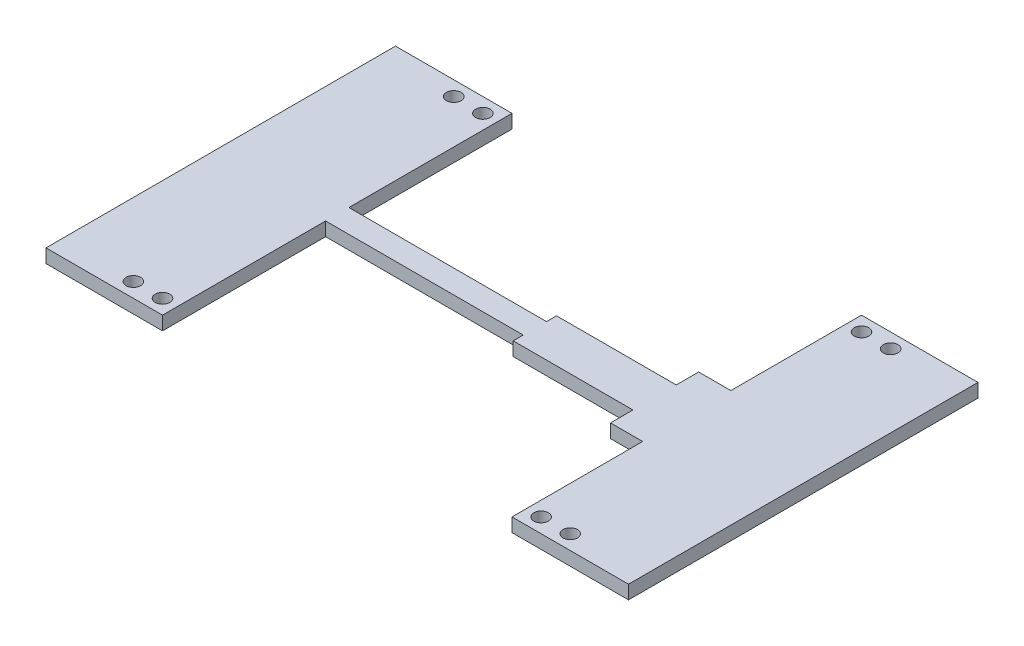
ISO-10303-21;
HEADER;
FILE_DESCRIPTION(('STEP AP214'),'2;1');
FILE_NAME('part.step','',(''),(''),'','','');
FILE_SCHEMA(('AUTOMOTIVE_DESIGN { 1 0 10303 214 1 1 1 1 }'));
ENDSEC;
DATA;
#1=APPLICATION_CONTEXT('core data for automotive mechanical design processes');
#2=APPLICATION_PROTOCOL_DEFINITION('international standard','automotive_design',2000,#1);
#3=PRODUCT_CONTEXT('',#1,'mechanical');
#4=PRODUCT('Part','Part','',(#3));
#5=PRODUCT_RELATED_PRODUCT_CATEGORY('part','',(#4));
#6=PRODUCT_DEFINITION_FORMATION('','',#4);
#7=PRODUCT_DEFINITION_CONTEXT('part definition',#1,'design');
#8=PRODUCT_DEFINITION('design','',#6,#7);
#9=PRODUCT_DEFINITION_SHAPE('','',#8);
#10=(LENGTH_UNIT() NAMED_UNIT(*) SI_UNIT(.MILLI.,.METRE.));
#11=(NAMED_UNIT(*) PLANE_ANGLE_UNIT() SI_UNIT($,.RADIAN.));
#12=(NAMED_UNIT(*) SI_UNIT($,.STERADIAN.) SOLID_ANGLE_UNIT());
#13=UNCERTAINTY_MEASURE_WITH_UNIT(LENGTH_MEASURE(1.E-05),#10,'distance_accuracy_value','');
#14=(GEOMETRIC_REPRESENTATION_CONTEXT(3) GLOBAL_UNCERTAINTY_ASSIGNED_CONTEXT((#13)) GLOBAL_UNIT_ASSIGNED_CONTEXT((#10,
#11,#12)) REPRESENTATION_CONTEXT('',''));
#15=CARTESIAN_POINT('',(0.,0.,0.));
#16=DIRECTION('',(0.,0.,1.));
#17=DIRECTION('',(1.,0.,0.));
#18=AXIS2_PLACEMENT_3D('',#15,#16,#17);
#19=CARTESIAN_POINT('',(-63.5,2.9718,-38.1));
#20=DIRECTION('',(0.,0.,1.));
#21=DIRECTION('',(1.,0.,0.));
#22=AXIS2_PLACEMENT_3D('',#19,#20,#21);
#23=PLANE('',#22);
#24=DIRECTION('',(0.,1.,0.));
#25=VECTOR('',#24,1.);
#26=CARTESIAN_POINT('',(-38.1,0.,-38.1));
#27=LINE('',#26,#25);
#28=CARTESIAN_POINT('',(-38.1,0.,-38.1));
#29=VERTEX_POINT('',#28);
#30=CARTESIAN_POINT('',(-38.1,2.9718,-38.1));
#31=VERTEX_POINT('',#30);
#32=EDGE_CURVE('E289',#29,#31,#27,.T.);
#33=ORIENTED_EDGE('',*,*,#32,.F.);
#34=DIRECTION('',(-1.,0.,0.));
#35=VECTOR('',#34,1.);
#36=CARTESIAN_POINT('',(-63.5,0.,-38.1));
#37=LINE('',#36,#35);
#38=CARTESIAN_POINT('',(-63.5,0.,-38.1));
#39=VERTEX_POINT('',#38);
#40=EDGE_CURVE('E239',#29,#39,#37,.T.);
#41=ORIENTED_EDGE('',*,*,#40,.T.);
#42=DIRECTION('',(0.,-1.,0.));
#43=VECTOR('',#42,1.);
#44=CARTESIAN_POINT('',(-63.5,2.9718,-38.1));
#45=LINE('',#44,#43);
#46=CARTESIAN_POINT('',(-63.5,2.9718,-38.1));
#47=VERTEX_POINT('',#46);
#48=EDGE_CURVE('E50',#47,#39,#45,.T.);
#49=ORIENTED_EDGE('',*,*,#48,.F.);
#50=DIRECTION('',(-1.,0.,0.));
#51=VECTOR('',#50,1.);
#52=CARTESIAN_POINT('',(-63.5,2.9718,-38.1));
#53=LINE('',#52,#51);
#54=EDGE_CURVE('E419',#31,#47,#53,.T.);
#55=ORIENTED_EDGE('',*,*,#54,.F.);
#56=EDGE_LOOP('',(#33,#41,#49,#55));
#57=FACE_BOUND('',#56,.T.);
#58=ADVANCED_FACE('F41',(#57),#23,.F.);
#59=CARTESIAN_POINT('',(0.,2.9718,0.));
#60=DIRECTION('',(0.,1.,0.));
#61=DIRECTION('',(0.,0.,1.));
#62=AXIS2_PLACEMENT_3D('',#59,#60,#61);
#63=PLANE('',#62);
#64=CARTESIAN_POINT('',(41.275,2.9718,-34.925));
#65=DIRECTION('',(0.,-1.,0.));
#66=DIRECTION('',(0.,0.,-1.));
#67=AXIS2_PLACEMENT_3D('',#64,#65,#66);
#68=CIRCLE('',#67,1.5875);
#69=CARTESIAN_POINT('',(41.275,2.9718,-36.5125));
#70=VERTEX_POINT('',#69);
#71=EDGE_CURVE('E248',#70,#70,#68,.T.);
#72=ORIENTED_EDGE('',*,*,#71,.T.);
#73=EDGE_LOOP('',(#72));
#74=FACE_BOUND('',#73,.T.);
#75=CARTESIAN_POINT('',(47.625,2.9718,-34.925));
#76=DIRECTION('',(0.,-1.,0.));
#77=DIRECTION('',(0.,0.,-1.));
#78=AXIS2_PLACEMENT_3D('',#75,#76,#77);
#79=CIRCLE('',#78,1.5875);
#80=CARTESIAN_POINT('',(47.625,2.9718,-36.5125));
#81=VERTEX_POINT('',#80);
#82=EDGE_CURVE('E482',#81,#81,#79,.T.);
#83=ORIENTED_EDGE('',*,*,#82,.T.);
#84=EDGE_LOOP('',(#83));
#85=FACE_BOUND('',#84,.T.);
#86=CARTESIAN_POINT('',(-41.275,2.9718,34.925));
#87=DIRECTION('',(0.,1.,0.));
#88=DIRECTION('',(0.,0.,1.));
#89=AXIS2_PLACEMENT_3D('',#86,#87,#88);
#90=CIRCLE('',#89,1.5875);
#91=CARTESIAN_POINT('',(-41.275,2.9718,36.5125));
#92=VERTEX_POINT('',#91);
#93=EDGE_CURVE('E326',#92,#92,#90,.T.);
#94=ORIENTED_EDGE('',*,*,#93,.F.);
#95=EDGE_LOOP('',(#94));
#96=FACE_BOUND('',#95,.T.);
#97=CARTESIAN_POINT('',(41.275,2.9718,34.925));
#98=DIRECTION('',(0.,1.,0.));
#99=DIRECTION('',(0.,0.,1.));
#100=AXIS2_PLACEMENT_3D('',#97,#98,#99);
#101=CIRCLE('',#100,1.5875);
#102=CARTESIAN_POINT('',(41.275,2.9718,36.5125));
#103=VERTEX_POINT('',#102);
#104=EDGE_CURVE('E335',#103,#103,#101,.T.);
#105=ORIENTED_EDGE('',*,*,#104,.F.);
#106=EDGE_LOOP('',(#105));
#107=FACE_BOUND('',#106,.T.);
#108=CARTESIAN_POINT('',(-47.625,2.9718,34.925));
#109=DIRECTION('',(0.,1.,0.));
#110=DIRECTION('',(0.,0.,1.));
#111=AXIS2_PLACEMENT_3D('',#108,#109,#110);
#112=CIRCLE('',#111,1.5875);
#113=CARTESIAN_POINT('',(-47.625,2.9718,36.5125));
#114=VERTEX_POINT('',#113);
#115=EDGE_CURVE('E310',#114,#114,#112,.T.);
#116=ORIENTED_EDGE('',*,*,#115,.F.);
#117=EDGE_LOOP('',(#116));
#118=FACE_BOUND('',#117,.T.);
#119=CARTESIAN_POINT('',(47.625,2.9718,34.925));
#120=DIRECTION('',(0.,1.,0.));
#121=DIRECTION('',(0.,0.,1.));
#122=AXIS2_PLACEMENT_3D('',#119,#120,#121);
#123=CIRCLE('',#122,1.5875);
#124=CARTESIAN_POINT('',(47.625,2.9718,36.5125));
#125=VERTEX_POINT('',#124);
#126=EDGE_CURVE('E319',#125,#125,#123,.T.);
#127=ORIENTED_EDGE('',*,*,#126,.F.);
#128=EDGE_LOOP('',(#127));
#129=FACE_BOUND('',#128,.T.);
#130=DIRECTION('',(1.,0.,0.));
#131=VECTOR('',#130,1.);
#132=CARTESIAN_POINT('',(0.,2.9718,-2.54000000000002));
#133=LINE('',#132,#131);
#134=CARTESIAN_POINT('',(-38.1,2.9718,-2.54000000000002));
#135=VERTEX_POINT('',#134);
#136=CARTESIAN_POINT('',(4.97874959599973,2.9718,-2.54000000000002));
#137=VERTEX_POINT('',#136);
#138=EDGE_CURVE('E270',#135,#137,#133,.T.);
#139=ORIENTED_EDGE('',*,*,#138,.F.);
#140=DIRECTION('',(0.,0.,-1.));
#141=VECTOR('',#140,1.);
#142=CARTESIAN_POINT('',(-38.1,2.9718,0.));
#143=LINE('',#142,#141);
#144=EDGE_CURVE('E221',#135,#31,#143,.T.);
#145=ORIENTED_EDGE('',*,*,#144,.T.);
#146=ORIENTED_EDGE('',*,*,#54,.T.);
#147=DIRECTION('',(0.,0.,1.));
#148=VECTOR('',#147,1.);
#149=CARTESIAN_POINT('',(-63.5,2.9718,-38.1));
#150=LINE('',#149,#148);
#151=CARTESIAN_POINT('',(-63.5,2.9718,38.1));
#152=VERTEX_POINT('',#151);
#153=EDGE_CURVE('E425',#47,#152,#150,.T.);
#154=ORIENTED_EDGE('',*,*,#153,.T.);
#155=DIRECTION('',(1.,0.,0.));
#156=VECTOR('',#155,1.);
#157=CARTESIAN_POINT('',(-63.5,2.9718,38.1));
#158=LINE('',#157,#156);
#159=CARTESIAN_POINT('',(-38.1,2.9718,38.1));
#160=VERTEX_POINT('',#159);
#161=EDGE_CURVE('E429',#152,#160,#158,.T.);
#162=ORIENTED_EDGE('',*,*,#161,.T.);
#163=DIRECTION('',(0.,0.,1.));
#164=VECTOR('',#163,1.);
#165=CARTESIAN_POINT('',(-38.1,2.9718,0.));
#166=LINE('',#165,#164);
#167=CARTESIAN_POINT('',(-38.1,2.9718,2.54000000000002));
#168=VERTEX_POINT('',#167);
#169=EDGE_CURVE('E330',#168,#160,#166,.T.);
#170=ORIENTED_EDGE('',*,*,#169,.F.);
#171=DIRECTION('',(1.,0.,0.));
#172=VECTOR('',#171,1.);
#173=CARTESIAN_POINT('',(0.,2.9718,2.54000000000002));
#174=LINE('',#173,#172);
#175=CARTESIAN_POINT('',(4.97874959599973,2.9718,2.54000000000002));
#176=VERTEX_POINT('',#175);
#177=EDGE_CURVE('E347',#168,#176,#174,.T.);
#178=ORIENTED_EDGE('',*,*,#177,.T.);
#179=DIRECTION('',(0.,0.,1.));
#180=VECTOR('',#179,1.);
#181=CARTESIAN_POINT('',(4.97874959599973,2.9718,0.));
#182=LINE('',#181,#180);
#183=CARTESIAN_POINT('',(4.97874959599973,2.9718,4.72478924459127));
#184=VERTEX_POINT('',#183);
#185=EDGE_CURVE('E384',#176,#184,#182,.T.);
#186=ORIENTED_EDGE('',*,*,#185,.T.);
#187=DIRECTION('',(1.,0.,0.));
#188=VECTOR('',#187,1.);
#189=CARTESIAN_POINT('',(0.,2.9718,4.72478924459127));
#190=LINE('',#189,#188);
#191=CARTESIAN_POINT('',(31.0867343843955,2.9718,4.72478924459127));
#192=VERTEX_POINT('',#191);
#193=EDGE_CURVE('E380',#184,#192,#190,.T.);
#194=ORIENTED_EDGE('',*,*,#193,.T.);
#195=DIRECTION('',(0.,0.,1.));
#196=VECTOR('',#195,1.);
#197=CARTESIAN_POINT('',(31.0867343843955,2.9718,0.));
#198=LINE('',#197,#196);
#199=CARTESIAN_POINT('',(31.0867343843955,2.9718,9.61413539475921));
#200=VERTEX_POINT('',#199);
#201=EDGE_CURVE('E376',#192,#200,#198,.T.);
#202=ORIENTED_EDGE('',*,*,#201,.T.);
#203=DIRECTION('',(1.,0.,0.));
#204=VECTOR('',#203,1.);
#205=CARTESIAN_POINT('',(0.,2.9718,9.61413539475922));
#206=LINE('',#205,#204);
#207=CARTESIAN_POINT('',(38.1,2.9718,9.61413539475921));
#208=VERTEX_POINT('',#207);
#209=EDGE_CURVE('E372',#200,#208,#206,.T.);
#210=ORIENTED_EDGE('',*,*,#209,.T.);
#211=DIRECTION('',(0.,0.,1.));
#212=VECTOR('',#211,1.);
#213=CARTESIAN_POINT('',(38.1,2.9718,0.));
#214=LINE('',#213,#212);
#215=CARTESIAN_POINT('',(38.1,2.9718,38.1));
#216=VERTEX_POINT('',#215);
#217=EDGE_CURVE('E368',#208,#216,#214,.T.);
#218=ORIENTED_EDGE('',*,*,#217,.T.);
#219=CARTESIAN_POINT('',(63.5,2.9718,38.1));
#220=VERTEX_POINT('',#219);
#221=EDGE_CURVE('E428',#216,#220,#158,.T.);
#222=ORIENTED_EDGE('',*,*,#221,.T.);
#223=DIRECTION('',(0.,0.,-1.));
#224=VECTOR('',#223,1.);
#225=CARTESIAN_POINT('',(63.5,2.9718,-38.1));
#226=LINE('',#225,#224);
#227=CARTESIAN_POINT('',(63.5,2.9718,-38.1));
#228=VERTEX_POINT('',#227);
#229=EDGE_CURVE('E415',#220,#228,#226,.T.);
#230=ORIENTED_EDGE('',*,*,#229,.T.);
#231=CARTESIAN_POINT('',(38.1,2.9718,-38.1));
#232=VERTEX_POINT('',#231);
#233=EDGE_CURVE('E421',#228,#232,#53,.T.);
#234=ORIENTED_EDGE('',*,*,#233,.T.);
#235=DIRECTION('',(0.,0.,-1.));
#236=VECTOR('',#235,1.);
#237=CARTESIAN_POINT('',(38.1,2.9718,0.));
#238=LINE('',#237,#236);
#239=CARTESIAN_POINT('',(38.1,2.9718,-9.61413539475921));
#240=VERTEX_POINT('',#239);
#241=EDGE_CURVE('E241',#240,#232,#238,.T.);
#242=ORIENTED_EDGE('',*,*,#241,.F.);
#243=DIRECTION('',(1.,0.,0.));
#244=VECTOR('',#243,1.);
#245=CARTESIAN_POINT('',(0.,2.9718,-9.61413539475922));
#246=LINE('',#245,#244);
#247=CARTESIAN_POINT('',(31.0867343843955,2.9718,-9.61413539475921));
#248=VERTEX_POINT('',#247);
#249=EDGE_CURVE('E245',#248,#240,#246,.T.);
#250=ORIENTED_EDGE('',*,*,#249,.F.);
#251=DIRECTION('',(0.,0.,-1.));
#252=VECTOR('',#251,1.);
#253=CARTESIAN_POINT('',(31.0867343843955,2.9718,0.));
#254=LINE('',#253,#252);
#255=CARTESIAN_POINT('',(31.0867343843955,2.9718,-4.72478924459127));
#256=VERTEX_POINT('',#255);
#257=EDGE_CURVE('E282',#256,#248,#254,.T.);
#258=ORIENTED_EDGE('',*,*,#257,.F.);
#259=DIRECTION('',(1.,0.,0.));
#260=VECTOR('',#259,1.);
#261=CARTESIAN_POINT('',(0.,2.9718,-4.72478924459127));
#262=LINE('',#261,#260);
#263=CARTESIAN_POINT('',(4.97874959599973,2.9718,-4.72478924459127));
#264=VERTEX_POINT('',#263);
#265=EDGE_CURVE('E278',#264,#256,#262,.T.);
#266=ORIENTED_EDGE('',*,*,#265,.F.);
#267=DIRECTION('',(0.,0.,-1.));
#268=VECTOR('',#267,1.);
#269=CARTESIAN_POINT('',(4.97874959599973,2.9718,0.));
#270=LINE('',#269,#268);
#271=EDGE_CURVE('E274',#137,#264,#270,.T.);
#272=ORIENTED_EDGE('',*,*,#271,.F.);
#273=EDGE_LOOP('',(#139,#145,#146,#154,#162,#170,#178,#186,#194,#202,#210,#218,#222,#230,#234,
#242,#250,#258,#266,#272));
#274=FACE_BOUND('',#273,.T.);
#275=CARTESIAN_POINT('',(-47.625,2.9718,-34.925));
#276=DIRECTION('',(0.,-1.,0.));
#277=DIRECTION('',(0.,0.,-1.));
#278=AXIS2_PLACEMENT_3D('',#275,#276,#277);
#279=CIRCLE('',#278,1.5875);
#280=CARTESIAN_POINT('',(-47.625,2.9718,-36.5125));
#281=VERTEX_POINT('',#280);
#282=EDGE_CURVE('E474',#281,#281,#279,.T.);
#283=ORIENTED_EDGE('',*,*,#282,.T.);
#284=EDGE_LOOP('',(#283));
#285=FACE_BOUND('',#284,.T.);
#286=CARTESIAN_POINT('',(-41.275,2.9718,-34.925));
#287=DIRECTION('',(0.,-1.,0.));
#288=DIRECTION('',(0.,0.,-1.));
#289=AXIS2_PLACEMENT_3D('',#286,#287,#288);
#290=CIRCLE('',#289,1.5875);
#291=CARTESIAN_POINT('',(-41.275,2.9718,-36.5125));
#292=VERTEX_POINT('',#291);
#293=EDGE_CURVE('E480',#292,#292,#290,.T.);
#294=ORIENTED_EDGE('',*,*,#293,.T.);
#295=EDGE_LOOP('',(#294));
#296=FACE_BOUND('',#295,.T.);
#297=ADVANCED_FACE('F470',(#74,#85,#96,#107,#118,#129,#274,#285,#296),#63,.T.);
#298=CARTESIAN_POINT('',(0.,0.,0.));
#299=DIRECTION('',(0.,1.,0.));
#300=DIRECTION('',(0.,0.,1.));
#301=AXIS2_PLACEMENT_3D('',#298,#299,#300);
#302=PLANE('',#301);
#303=CARTESIAN_POINT('',(47.625,0.,34.925));
#304=DIRECTION('',(0.,1.,0.));
#305=DIRECTION('',(0.,0.,1.));
#306=AXIS2_PLACEMENT_3D('',#303,#304,#305);
#307=CIRCLE('',#306,1.5875);
#308=CARTESIAN_POINT('',(47.625,0.,36.5125));
#309=VERTEX_POINT('',#308);
#310=EDGE_CURVE('E291',#309,#309,#307,.T.);
#311=ORIENTED_EDGE('',*,*,#310,.T.);
#312=EDGE_LOOP('',(#311));
#313=FACE_BOUND('',#312,.T.);
#314=CARTESIAN_POINT('',(-47.625,0.,34.925));
#315=DIRECTION('',(0.,1.,0.));
#316=DIRECTION('',(0.,0.,1.));
#317=AXIS2_PLACEMENT_3D('',#314,#315,#316);
#318=CIRCLE('',#317,1.5875);
#319=CARTESIAN_POINT('',(-47.625,0.,36.5125));
#320=VERTEX_POINT('',#319);
#321=EDGE_CURVE('E315',#320,#320,#318,.T.);
#322=ORIENTED_EDGE('',*,*,#321,.T.);
#323=EDGE_LOOP('',(#322));
#324=FACE_BOUND('',#323,.T.);
#325=CARTESIAN_POINT('',(41.275,0.,34.925));
#326=DIRECTION('',(0.,1.,0.));
#327=DIRECTION('',(0.,0.,1.));
#328=AXIS2_PLACEMENT_3D('',#325,#326,#327);
#329=CIRCLE('',#328,1.5875);
#330=CARTESIAN_POINT('',(41.275,0.,36.5125));
#331=VERTEX_POINT('',#330);
#332=EDGE_CURVE('E314',#331,#331,#329,.T.);
#333=ORIENTED_EDGE('',*,*,#332,.T.);
#334=EDGE_LOOP('',(#333));
#335=FACE_BOUND('',#334,.T.);
#336=CARTESIAN_POINT('',(-41.275,0.,34.925));
#337=DIRECTION('',(0.,1.,0.));
#338=DIRECTION('',(0.,0.,1.));
#339=AXIS2_PLACEMENT_3D('',#336,#337,#338);
#340=CIRCLE('',#339,1.5875);
#341=CARTESIAN_POINT('',(-41.275,0.,36.5125));
#342=VERTEX_POINT('',#341);
#343=EDGE_CURVE('E331',#342,#342,#340,.T.);
#344=ORIENTED_EDGE('',*,*,#343,.T.);
#345=EDGE_LOOP('',(#344));
#346=FACE_BOUND('',#345,.T.);
#347=DIRECTION('',(0.,0.,-1.));
#348=VECTOR('',#347,1.);
#349=CARTESIAN_POINT('',(-38.1,0.,0.));
#350=LINE('',#349,#348);
#351=CARTESIAN_POINT('',(-38.1,0.,-2.54000000000002));
#352=VERTEX_POINT('',#351);
#353=EDGE_CURVE('E218',#352,#29,#350,.T.);
#354=ORIENTED_EDGE('',*,*,#353,.F.);
#355=DIRECTION('',(1.,0.,0.));
#356=VECTOR('',#355,1.);
#357=CARTESIAN_POINT('',(0.,0.,-2.54000000000002));
#358=LINE('',#357,#356);
#359=CARTESIAN_POINT('',(4.97874959599973,0.,-2.54000000000002));
#360=VERTEX_POINT('',#359);
#361=EDGE_CURVE('E230',#352,#360,#358,.T.);
#362=ORIENTED_EDGE('',*,*,#361,.T.);
#363=DIRECTION('',(0.,0.,-1.));
#364=VECTOR('',#363,1.);
#365=CARTESIAN_POINT('',(4.97874959599973,0.,0.));
#366=LINE('',#365,#364);
#367=CARTESIAN_POINT('',(4.97874959599973,0.,-4.72478924459127));
#368=VERTEX_POINT('',#367);
#369=EDGE_CURVE('E60',#360,#368,#366,.T.);
#370=ORIENTED_EDGE('',*,*,#369,.T.);
#371=DIRECTION('',(1.,0.,0.));
#372=VECTOR('',#371,1.);
#373=CARTESIAN_POINT('',(0.,0.,-4.72478924459127));
#374=LINE('',#373,#372);
#375=CARTESIAN_POINT('',(31.0867343843955,0.,-4.72478924459127));
#376=VERTEX_POINT('',#375);
#377=EDGE_CURVE('E253',#368,#376,#374,.T.);
#378=ORIENTED_EDGE('',*,*,#377,.T.);
#379=DIRECTION('',(0.,0.,-1.));
#380=VECTOR('',#379,1.);
#381=CARTESIAN_POINT('',(31.0867343843955,0.,0.));
#382=LINE('',#381,#380);
#383=CARTESIAN_POINT('',(31.0867343843955,0.,-9.61413539475921));
#384=VERTEX_POINT('',#383);
#385=EDGE_CURVE('E257',#376,#384,#382,.T.);
#386=ORIENTED_EDGE('',*,*,#385,.T.);
#387=DIRECTION('',(1.,0.,0.));
#388=VECTOR('',#387,1.);
#389=CARTESIAN_POINT('',(0.,0.,-9.61413539475922));
#390=LINE('',#389,#388);
#391=CARTESIAN_POINT('',(38.1,0.,-9.61413539475921));
#392=VERTEX_POINT('',#391);
#393=EDGE_CURVE('E261',#384,#392,#390,.T.);
#394=ORIENTED_EDGE('',*,*,#393,.T.);
#395=DIRECTION('',(0.,0.,-1.));
#396=VECTOR('',#395,1.);
#397=CARTESIAN_POINT('',(38.1,0.,0.));
#398=LINE('',#397,#396);
#399=CARTESIAN_POINT('',(38.1,0.,-38.1));
#400=VERTEX_POINT('',#399);
#401=EDGE_CURVE('E227',#392,#400,#398,.T.);
#402=ORIENTED_EDGE('',*,*,#401,.T.);
#403=CARTESIAN_POINT('',(63.5,0.,-38.1));
#404=VERTEX_POINT('',#403);
#405=EDGE_CURVE('E437',#404,#400,#37,.T.);
#406=ORIENTED_EDGE('',*,*,#405,.F.);
#407=DIRECTION('',(0.,0.,-1.));
#408=VECTOR('',#407,1.);
#409=CARTESIAN_POINT('',(63.5,0.,-38.1));
#410=LINE('',#409,#408);
#411=CARTESIAN_POINT('',(63.5,0.,38.1));
#412=VERTEX_POINT('',#411);
#413=EDGE_CURVE('E394',#412,#404,#410,.T.);
#414=ORIENTED_EDGE('',*,*,#413,.F.);
#415=DIRECTION('',(1.,0.,0.));
#416=VECTOR('',#415,1.);
#417=CARTESIAN_POINT('',(-63.5,0.,38.1));
#418=LINE('',#417,#416);
#419=CARTESIAN_POINT('',(38.1,0.,38.1));
#420=VERTEX_POINT('',#419);
#421=EDGE_CURVE('E444',#420,#412,#418,.T.);
#422=ORIENTED_EDGE('',*,*,#421,.F.);
#423=DIRECTION('',(0.,0.,1.));
#424=VECTOR('',#423,1.);
#425=CARTESIAN_POINT('',(38.1,0.,0.));
#426=LINE('',#425,#424);
#427=CARTESIAN_POINT('',(38.1,0.,9.61413539475921));
#428=VERTEX_POINT('',#427);
#429=EDGE_CURVE('E346',#428,#420,#426,.T.);
#430=ORIENTED_EDGE('',*,*,#429,.F.);
#431=DIRECTION('',(1.,0.,0.));
#432=VECTOR('',#431,1.);
#433=CARTESIAN_POINT('',(0.,0.,9.61413539475922));
#434=LINE('',#433,#432);
#435=CARTESIAN_POINT('',(31.0867343843955,0.,9.61413539475921));
#436=VERTEX_POINT('',#435);
#437=EDGE_CURVE('E350',#436,#428,#434,.T.);
#438=ORIENTED_EDGE('',*,*,#437,.F.);
#439=DIRECTION('',(0.,0.,1.));
#440=VECTOR('',#439,1.);
#441=CARTESIAN_POINT('',(31.0867343843955,0.,0.));
#442=LINE('',#441,#440);
#443=CARTESIAN_POINT('',(31.0867343843955,0.,4.72478924459127));
#444=VERTEX_POINT('',#443);
#445=EDGE_CURVE('E353',#444,#436,#442,.T.);
#446=ORIENTED_EDGE('',*,*,#445,.F.);
#447=DIRECTION('',(1.,0.,0.));
#448=VECTOR('',#447,1.);
#449=CARTESIAN_POINT('',(0.,0.,4.72478924459127));
#450=LINE('',#449,#448);
#451=CARTESIAN_POINT('',(4.97874959599973,0.,4.72478924459127));
#452=VERTEX_POINT('',#451);
#453=EDGE_CURVE('E356',#452,#444,#450,.T.);
#454=ORIENTED_EDGE('',*,*,#453,.F.);
#455=DIRECTION('',(0.,0.,1.));
#456=VECTOR('',#455,1.);
#457=CARTESIAN_POINT('',(4.97874959599973,0.,0.));
#458=LINE('',#457,#456);
#459=CARTESIAN_POINT('',(4.97874959599973,0.,2.54000000000002));
#460=VERTEX_POINT('',#459);
#461=EDGE_CURVE('E359',#460,#452,#458,.T.);
#462=ORIENTED_EDGE('',*,*,#461,.F.);
#463=DIRECTION('',(1.,0.,0.));
#464=VECTOR('',#463,1.);
#465=CARTESIAN_POINT('',(0.,0.,2.54000000000002));
#466=LINE('',#465,#464);
#467=CARTESIAN_POINT('',(-38.1,0.,2.54000000000002));
#468=VERTEX_POINT('',#467);
#469=EDGE_CURVE('E362',#468,#460,#466,.T.);
#470=ORIENTED_EDGE('',*,*,#469,.F.);
#471=DIRECTION('',(0.,0.,1.));
#472=VECTOR('',#471,1.);
#473=CARTESIAN_POINT('',(-38.1,0.,0.));
#474=LINE('',#473,#472);
#475=CARTESIAN_POINT('',(-38.1,0.,38.1));
#476=VERTEX_POINT('',#475);
#477=EDGE_CURVE('E342',#468,#476,#474,.T.);
#478=ORIENTED_EDGE('',*,*,#477,.T.);
#479=CARTESIAN_POINT('',(-63.5,0.,38.1));
#480=VERTEX_POINT('',#479);
#481=EDGE_CURVE('E420',#480,#476,#418,.T.);
#482=ORIENTED_EDGE('',*,*,#481,.F.);
#483=DIRECTION('',(0.,0.,1.));
#484=VECTOR('',#483,1.);
#485=CARTESIAN_POINT('',(-63.5,0.,-38.1));
#486=LINE('',#485,#484);
#487=EDGE_CURVE('E441',#39,#480,#486,.T.);
#488=ORIENTED_EDGE('',*,*,#487,.F.);
#489=ORIENTED_EDGE('',*,*,#40,.F.);
#490=EDGE_LOOP('',(#354,#362,#370,#378,#386,#394,#402,#406,#414,#422,#430,#438,#446,#454,#462,
#470,#478,#482,#488,#489));
#491=FACE_BOUND('',#490,.T.);
#492=CARTESIAN_POINT('',(47.625,0.,-34.925));
#493=DIRECTION('',(0.,-1.,0.));
#494=DIRECTION('',(0.,0.,-1.));
#495=AXIS2_PLACEMENT_3D('',#492,#493,#494);
#496=CIRCLE('',#495,1.5875);
#497=CARTESIAN_POINT('',(47.625,0.,-36.5125));
#498=VERTEX_POINT('',#497);
#499=EDGE_CURVE('E484',#498,#498,#496,.T.);
#500=ORIENTED_EDGE('',*,*,#499,.F.);
#501=EDGE_LOOP('',(#500));
#502=FACE_BOUND('',#501,.T.);
#503=CARTESIAN_POINT('',(-47.625,0.,-34.925));
#504=DIRECTION('',(0.,-1.,0.));
#505=DIRECTION('',(0.,0.,-1.));
#506=AXIS2_PLACEMENT_3D('',#503,#504,#505);
#507=CIRCLE('',#506,1.5875);
#508=CARTESIAN_POINT('',(-47.625,0.,-36.5125));
#509=VERTEX_POINT('',#508);
#510=EDGE_CURVE('E492',#509,#509,#507,.T.);
#511=ORIENTED_EDGE('',*,*,#510,.F.);
#512=EDGE_LOOP('',(#511));
#513=FACE_BOUND('',#512,.T.);
#514=CARTESIAN_POINT('',(41.275,0.,-34.925));
#515=DIRECTION('',(0.,-1.,0.));
#516=DIRECTION('',(0.,0.,-1.));
#517=AXIS2_PLACEMENT_3D('',#514,#515,#516);
#518=CIRCLE('',#517,1.5875);
#519=CARTESIAN_POINT('',(41.275,0.,-36.5125));
#520=VERTEX_POINT('',#519);
#521=EDGE_CURVE('E478',#520,#520,#518,.T.);
#522=ORIENTED_EDGE('',*,*,#521,.F.);
#523=EDGE_LOOP('',(#522));
#524=FACE_BOUND('',#523,.T.);
#525=CARTESIAN_POINT('',(-41.275,0.,-34.925));
#526=DIRECTION('',(0.,-1.,0.));
#527=DIRECTION('',(0.,0.,-1.));
#528=AXIS2_PLACEMENT_3D('',#525,#526,#527);
#529=CIRCLE('',#528,1.5875);
#530=CARTESIAN_POINT('',(-41.275,0.,-36.5125));
#531=VERTEX_POINT('',#530);
#532=EDGE_CURVE('E271',#531,#531,#529,.T.);
#533=ORIENTED_EDGE('',*,*,#532,.F.);
#534=EDGE_LOOP('',(#533));
#535=FACE_BOUND('',#534,.T.);
#536=ADVANCED_FACE('F236',(#313,#324,#335,#346,#491,#502,#513,#524,#535),#302,.F.);
#537=CARTESIAN_POINT('',(-63.5,2.9718,38.1));
#538=DIRECTION('',(0.,0.,-1.));
#539=DIRECTION('',(-1.,0.,0.));
#540=AXIS2_PLACEMENT_3D('',#537,#538,#539);
#541=PLANE('',#540);
#542=DIRECTION('',(0.,1.,0.));
#543=VECTOR('',#542,1.);
#544=CARTESIAN_POINT('',(38.1,0.,38.1));
#545=LINE('',#544,#543);
#546=EDGE_CURVE('E409',#420,#216,#545,.T.);
#547=ORIENTED_EDGE('',*,*,#546,.F.);
#548=ORIENTED_EDGE('',*,*,#421,.T.);
#549=DIRECTION('',(0.,-1.,0.));
#550=VECTOR('',#549,1.);
#551=CARTESIAN_POINT('',(63.5,2.9718,38.1));
#552=LINE('',#551,#550);
#553=EDGE_CURVE('E433',#220,#412,#552,.T.);
#554=ORIENTED_EDGE('',*,*,#553,.F.);
#555=ORIENTED_EDGE('',*,*,#221,.F.);
#556=EDGE_LOOP('',(#547,#548,#554,#555));
#557=FACE_BOUND('',#556,.T.);
#558=ADVANCED_FACE('F531',(#557),#541,.F.);
#559=CARTESIAN_POINT('',(63.5,2.9718,-38.1));
#560=DIRECTION('',(-1.,0.,0.));
#561=DIRECTION('',(0.,0.,1.));
#562=AXIS2_PLACEMENT_3D('',#559,#560,#561);
#563=PLANE('',#562);
#564=ORIENTED_EDGE('',*,*,#413,.T.);
#565=DIRECTION('',(0.,-1.,0.));
#566=VECTOR('',#565,1.);
#567=CARTESIAN_POINT('',(63.5,2.9718,-38.1));
#568=LINE('',#567,#566);
#569=EDGE_CURVE('E11',#228,#404,#568,.T.);
#570=ORIENTED_EDGE('',*,*,#569,.F.);
#571=ORIENTED_EDGE('',*,*,#229,.F.);
#572=ORIENTED_EDGE('',*,*,#553,.T.);
#573=EDGE_LOOP('',(#564,#570,#571,#572));
#574=FACE_BOUND('',#573,.T.);
#575=ADVANCED_FACE('F43',(#574),#563,.F.);
#576=ORIENTED_EDGE('',*,*,#405,.T.);
#577=DIRECTION('',(0.,1.,0.));
#578=VECTOR('',#577,1.);
#579=CARTESIAN_POINT('',(38.1,0.,-38.1));
#580=LINE('',#579,#578);
#581=EDGE_CURVE('E292',#400,#232,#580,.T.);
#582=ORIENTED_EDGE('',*,*,#581,.T.);
#583=ORIENTED_EDGE('',*,*,#233,.F.);
#584=ORIENTED_EDGE('',*,*,#569,.T.);
#585=EDGE_LOOP('',(#576,#582,#583,#584));
#586=FACE_BOUND('',#585,.T.);
#587=ADVANCED_FACE('F518',(#586),#23,.F.);
#588=CARTESIAN_POINT('',(-63.5,2.9718,-38.1));
#589=DIRECTION('',(1.,0.,0.));
#590=DIRECTION('',(0.,0.,-1.));
#591=AXIS2_PLACEMENT_3D('',#588,#589,#590);
#592=PLANE('',#591);
#593=ORIENTED_EDGE('',*,*,#487,.T.);
#594=DIRECTION('',(0.,-1.,0.));
#595=VECTOR('',#594,1.);
#596=CARTESIAN_POINT('',(-63.5,2.9718,38.1));
#597=LINE('',#596,#595);
#598=EDGE_CURVE('E451',#152,#480,#597,.T.);
#599=ORIENTED_EDGE('',*,*,#598,.F.);
#600=ORIENTED_EDGE('',*,*,#153,.F.);
#601=ORIENTED_EDGE('',*,*,#48,.T.);
#602=EDGE_LOOP('',(#593,#599,#600,#601));
#603=FACE_BOUND('',#602,.T.);
#604=ADVANCED_FACE('F458',(#603),#592,.F.);
#605=ORIENTED_EDGE('',*,*,#481,.T.);
#606=DIRECTION('',(0.,1.,0.));
#607=VECTOR('',#606,1.);
#608=CARTESIAN_POINT('',(-38.1,0.,38.1));
#609=LINE('',#608,#607);
#610=EDGE_CURVE('E365',#476,#160,#609,.T.);
#611=ORIENTED_EDGE('',*,*,#610,.T.);
#612=ORIENTED_EDGE('',*,*,#161,.F.);
#613=ORIENTED_EDGE('',*,*,#598,.T.);
#614=EDGE_LOOP('',(#605,#611,#612,#613));
#615=FACE_BOUND('',#614,.T.);
#616=ADVANCED_FACE('F466',(#615),#541,.F.);
#617=CARTESIAN_POINT('',(-38.1,0.,0.));
#618=DIRECTION('',(-1.,0.,0.));
#619=DIRECTION('',(0.,0.,1.));
#620=AXIS2_PLACEMENT_3D('',#617,#618,#619);
#621=PLANE('',#620);
#622=ORIENTED_EDGE('',*,*,#169,.T.);
#623=ORIENTED_EDGE('',*,*,#610,.F.);
#624=ORIENTED_EDGE('',*,*,#477,.F.);
#625=DIRECTION('',(0.,1.,0.));
#626=VECTOR('',#625,1.);
#627=CARTESIAN_POINT('',(-38.1,0.,2.54000000000002));
#628=LINE('',#627,#626);
#629=EDGE_CURVE('E391',#468,#168,#628,.T.);
#630=ORIENTED_EDGE('',*,*,#629,.T.);
#631=EDGE_LOOP('',(#622,#623,#624,#630));
#632=FACE_BOUND('',#631,.T.);
#633=ADVANCED_FACE('F574',(#632),#621,.F.);
#634=CARTESIAN_POINT('',(0.,0.,2.54000000000002));
#635=DIRECTION('',(0.,0.,1.));
#636=DIRECTION('',(1.,0.,0.));
#637=AXIS2_PLACEMENT_3D('',#634,#635,#636);
#638=PLANE('',#637);
#639=ORIENTED_EDGE('',*,*,#177,.F.);
#640=ORIENTED_EDGE('',*,*,#629,.F.);
#641=ORIENTED_EDGE('',*,*,#469,.T.);
#642=DIRECTION('',(0.,1.,0.));
#643=VECTOR('',#642,1.);
#644=CARTESIAN_POINT('',(4.97874959599973,0.,2.54000000000002));
#645=LINE('',#644,#643);
#646=EDGE_CURVE('E395',#460,#176,#645,.T.);
#647=ORIENTED_EDGE('',*,*,#646,.T.);
#648=EDGE_LOOP('',(#639,#640,#641,#647));
#649=FACE_BOUND('',#648,.T.);
#650=ADVANCED_FACE('F572',(#649),#638,.T.);
#651=CARTESIAN_POINT('',(4.97874959599973,0.,0.));
#652=DIRECTION('',(-1.,0.,0.));
#653=DIRECTION('',(0.,0.,1.));
#654=AXIS2_PLACEMENT_3D('',#651,#652,#653);
#655=PLANE('',#654);
#656=ORIENTED_EDGE('',*,*,#185,.F.);
#657=ORIENTED_EDGE('',*,*,#646,.F.);
#658=ORIENTED_EDGE('',*,*,#461,.T.);
#659=DIRECTION('',(0.,1.,0.));
#660=VECTOR('',#659,1.);
#661=CARTESIAN_POINT('',(4.97874959599973,0.,4.72478924459127));
#662=LINE('',#661,#660);
#663=EDGE_CURVE('E398',#452,#184,#662,.T.);
#664=ORIENTED_EDGE('',*,*,#663,.T.);
#665=EDGE_LOOP('',(#656,#657,#658,#664));
#666=FACE_BOUND('',#665,.T.);
#667=ADVANCED_FACE('F568',(#666),#655,.T.);
#668=CARTESIAN_POINT('',(0.,0.,4.72478924459127));
#669=DIRECTION('',(0.,0.,1.));
#670=DIRECTION('',(1.,0.,0.));
#671=AXIS2_PLACEMENT_3D('',#668,#669,#670);
#672=PLANE('',#671);
#673=ORIENTED_EDGE('',*,*,#193,.F.);
#674=ORIENTED_EDGE('',*,*,#663,.F.);
#675=ORIENTED_EDGE('',*,*,#453,.T.);
#676=DIRECTION('',(0.,1.,0.));
#677=VECTOR('',#676,1.);
#678=CARTESIAN_POINT('',(31.0867343843955,0.,4.72478924459127));
#679=LINE('',#678,#677);
#680=EDGE_CURVE('E401',#444,#192,#679,.T.);
#681=ORIENTED_EDGE('',*,*,#680,.T.);
#682=EDGE_LOOP('',(#673,#674,#675,#681));
#683=FACE_BOUND('',#682,.T.);
#684=ADVANCED_FACE('F565',(#683),#672,.T.);
#685=CARTESIAN_POINT('',(31.0867343843955,0.,0.));
#686=DIRECTION('',(-1.,0.,0.));
#687=DIRECTION('',(0.,0.,1.));
#688=AXIS2_PLACEMENT_3D('',#685,#686,#687);
#689=PLANE('',#688);
#690=ORIENTED_EDGE('',*,*,#201,.F.);
#691=ORIENTED_EDGE('',*,*,#680,.F.);
#692=ORIENTED_EDGE('',*,*,#445,.T.);
#693=DIRECTION('',(0.,1.,0.));
#694=VECTOR('',#693,1.);
#695=CARTESIAN_POINT('',(31.0867343843955,0.,9.61413539475921));
#696=LINE('',#695,#694);
#697=EDGE_CURVE('E404',#436,#200,#696,.T.);
#698=ORIENTED_EDGE('',*,*,#697,.T.);
#699=EDGE_LOOP('',(#690,#691,#692,#698));
#700=FACE_BOUND('',#699,.T.);
#701=ADVANCED_FACE('F558',(#700),#689,.T.);
#702=CARTESIAN_POINT('',(0.,0.,9.61413539475922));
#703=DIRECTION('',(0.,0.,1.));
#704=DIRECTION('',(1.,0.,0.));
#705=AXIS2_PLACEMENT_3D('',#702,#703,#704);
#706=PLANE('',#705);
#707=ORIENTED_EDGE('',*,*,#209,.F.);
#708=ORIENTED_EDGE('',*,*,#697,.F.);
#709=ORIENTED_EDGE('',*,*,#437,.T.);
#710=DIRECTION('',(0.,1.,0.));
#711=VECTOR('',#710,1.);
#712=CARTESIAN_POINT('',(38.1,0.,9.61413539475921));
#713=LINE('',#712,#711);
#714=EDGE_CURVE('E71',#428,#208,#713,.T.);
#715=ORIENTED_EDGE('',*,*,#714,.T.);
#716=EDGE_LOOP('',(#707,#708,#709,#715));
#717=FACE_BOUND('',#716,.T.);
#718=ADVANCED_FACE('F556',(#717),#706,.T.);
#719=CARTESIAN_POINT('',(38.1,0.,0.));
#720=DIRECTION('',(-1.,0.,0.));
#721=DIRECTION('',(0.,0.,1.));
#722=AXIS2_PLACEMENT_3D('',#719,#720,#721);
#723=PLANE('',#722);
#724=ORIENTED_EDGE('',*,*,#217,.F.);
#725=ORIENTED_EDGE('',*,*,#714,.F.);
#726=ORIENTED_EDGE('',*,*,#429,.T.);
#727=ORIENTED_EDGE('',*,*,#546,.T.);
#728=EDGE_LOOP('',(#724,#725,#726,#727));
#729=FACE_BOUND('',#728,.T.);
#730=ADVANCED_FACE('F551',(#729),#723,.T.);
#731=CARTESIAN_POINT('',(47.625,0.,34.925));
#732=DIRECTION('',(0.,1.,0.));
#733=DIRECTION('',(0.,0.,1.));
#734=AXIS2_PLACEMENT_3D('',#731,#732,#733);
#735=CYLINDRICAL_SURFACE('',#734,1.5875);
#736=ORIENTED_EDGE('',*,*,#310,.F.);
#737=EDGE_LOOP('',(#736));
#738=FACE_BOUND('',#737,.T.);
#739=ORIENTED_EDGE('',*,*,#126,.T.);
#740=EDGE_LOOP('',(#739));
#741=FACE_BOUND('',#740,.T.);
#742=ADVANCED_FACE('F613',(#738,#741),#735,.F.);
#743=CARTESIAN_POINT('',(-47.625,0.,34.925));
#744=DIRECTION('',(0.,1.,0.));
#745=DIRECTION('',(0.,0.,1.));
#746=AXIS2_PLACEMENT_3D('',#743,#744,#745);
#747=CYLINDRICAL_SURFACE('',#746,1.5875);
#748=ORIENTED_EDGE('',*,*,#321,.F.);
#749=EDGE_LOOP('',(#748));
#750=FACE_BOUND('',#749,.T.);
#751=ORIENTED_EDGE('',*,*,#115,.T.);
#752=EDGE_LOOP('',(#751));
#753=FACE_BOUND('',#752,.T.);
#754=ADVANCED_FACE('F615',(#750,#753),#747,.F.);
#755=CARTESIAN_POINT('',(41.275,0.,34.925));
#756=DIRECTION('',(0.,1.,0.));
#757=DIRECTION('',(0.,0.,1.));
#758=AXIS2_PLACEMENT_3D('',#755,#756,#757);
#759=CYLINDRICAL_SURFACE('',#758,1.5875);
#760=ORIENTED_EDGE('',*,*,#332,.F.);
#761=EDGE_LOOP('',(#760));
#762=FACE_BOUND('',#761,.T.);
#763=ORIENTED_EDGE('',*,*,#104,.T.);
#764=EDGE_LOOP('',(#763));
#765=FACE_BOUND('',#764,.T.);
#766=ADVANCED_FACE('F602',(#762,#765),#759,.F.);
#767=CARTESIAN_POINT('',(-41.275,0.,34.925));
#768=DIRECTION('',(0.,1.,0.));
#769=DIRECTION('',(0.,0.,1.));
#770=AXIS2_PLACEMENT_3D('',#767,#768,#769);
#771=CYLINDRICAL_SURFACE('',#770,1.5875);
#772=ORIENTED_EDGE('',*,*,#343,.F.);
#773=EDGE_LOOP('',(#772));
#774=FACE_BOUND('',#773,.T.);
#775=ORIENTED_EDGE('',*,*,#93,.T.);
#776=EDGE_LOOP('',(#775));
#777=FACE_BOUND('',#776,.T.);
#778=ADVANCED_FACE('F599',(#774,#777),#771,.F.);
#779=CARTESIAN_POINT('',(-38.1,0.,0.));
#780=DIRECTION('',(1.,0.,0.));
#781=DIRECTION('',(0.,0.,-1.));
#782=AXIS2_PLACEMENT_3D('',#779,#780,#781);
#783=PLANE('',#782);
#784=ORIENTED_EDGE('',*,*,#144,.F.);
#785=DIRECTION('',(0.,1.,0.));
#786=VECTOR('',#785,1.);
#787=CARTESIAN_POINT('',(-38.1,0.,-2.54000000000002));
#788=LINE('',#787,#786);
#789=EDGE_CURVE('E214',#352,#135,#788,.T.);
#790=ORIENTED_EDGE('',*,*,#789,.F.);
#791=ORIENTED_EDGE('',*,*,#353,.T.);
#792=ORIENTED_EDGE('',*,*,#32,.T.);
#793=EDGE_LOOP('',(#784,#790,#791,#792));
#794=FACE_BOUND('',#793,.T.);
#795=ADVANCED_FACE('F216',(#794),#783,.T.);
#796=CARTESIAN_POINT('',(38.1,0.,0.));
#797=DIRECTION('',(1.,0.,0.));
#798=DIRECTION('',(0.,0.,-1.));
#799=AXIS2_PLACEMENT_3D('',#796,#797,#798);
#800=PLANE('',#799);
#801=ORIENTED_EDGE('',*,*,#241,.T.);
#802=ORIENTED_EDGE('',*,*,#581,.F.);
#803=ORIENTED_EDGE('',*,*,#401,.F.);
#804=DIRECTION('',(0.,1.,0.));
#805=VECTOR('',#804,1.);
#806=CARTESIAN_POINT('',(38.1,0.,-9.61413539475921));
#807=LINE('',#806,#805);
#808=EDGE_CURVE('E296',#392,#240,#807,.T.);
#809=ORIENTED_EDGE('',*,*,#808,.T.);
#810=EDGE_LOOP('',(#801,#802,#803,#809));
#811=FACE_BOUND('',#810,.T.);
#812=ADVANCED_FACE('F539',(#811),#800,.F.);
#813=CARTESIAN_POINT('',(0.,0.,-9.61413539475922));
#814=DIRECTION('',(0.,0.,1.));
#815=DIRECTION('',(1.,0.,0.));
#816=AXIS2_PLACEMENT_3D('',#813,#814,#815);
#817=PLANE('',#816);
#818=ORIENTED_EDGE('',*,*,#249,.T.);
#819=ORIENTED_EDGE('',*,*,#808,.F.);
#820=ORIENTED_EDGE('',*,*,#393,.F.);
#821=DIRECTION('',(0.,1.,0.));
#822=VECTOR('',#821,1.);
#823=CARTESIAN_POINT('',(31.0867343843955,0.,-9.61413539475921));
#824=LINE('',#823,#822);
#825=EDGE_CURVE('E299',#384,#248,#824,.T.);
#826=ORIENTED_EDGE('',*,*,#825,.T.);
#827=EDGE_LOOP('',(#818,#819,#820,#826));
#828=FACE_BOUND('',#827,.T.);
#829=ADVANCED_FACE('F737',(#828),#817,.F.);
#830=CARTESIAN_POINT('',(31.0867343843955,0.,0.));
#831=DIRECTION('',(1.,0.,0.));
#832=DIRECTION('',(0.,0.,-1.));
#833=AXIS2_PLACEMENT_3D('',#830,#831,#832);
#834=PLANE('',#833);
#835=ORIENTED_EDGE('',*,*,#257,.T.);
#836=ORIENTED_EDGE('',*,*,#825,.F.);
#837=ORIENTED_EDGE('',*,*,#385,.F.);
#838=DIRECTION('',(0.,1.,0.));
#839=VECTOR('',#838,1.);
#840=CARTESIAN_POINT('',(31.0867343843955,0.,-4.72478924459127));
#841=LINE('',#840,#839);
#842=EDGE_CURVE('E302',#376,#256,#841,.T.);
#843=ORIENTED_EDGE('',*,*,#842,.T.);
#844=EDGE_LOOP('',(#835,#836,#837,#843));
#845=FACE_BOUND('',#844,.T.);
#846=ADVANCED_FACE('F749',(#845),#834,.F.);
#847=CARTESIAN_POINT('',(0.,0.,-4.72478924459127));
#848=DIRECTION('',(0.,0.,1.));
#849=DIRECTION('',(1.,0.,0.));
#850=AXIS2_PLACEMENT_3D('',#847,#848,#849);
#851=PLANE('',#850);
#852=ORIENTED_EDGE('',*,*,#265,.T.);
#853=ORIENTED_EDGE('',*,*,#842,.F.);
#854=ORIENTED_EDGE('',*,*,#377,.F.);
#855=DIRECTION('',(0.,1.,0.));
#856=VECTOR('',#855,1.);
#857=CARTESIAN_POINT('',(4.97874959599973,0.,-4.72478924459127));
#858=LINE('',#857,#856);
#859=EDGE_CURVE('E305',#368,#264,#858,.T.);
#860=ORIENTED_EDGE('',*,*,#859,.T.);
#861=EDGE_LOOP('',(#852,#853,#854,#860));
#862=FACE_BOUND('',#861,.T.);
#863=ADVANCED_FACE('F675',(#862),#851,.F.);
#864=CARTESIAN_POINT('',(4.97874959599973,0.,0.));
#865=DIRECTION('',(1.,0.,0.));
#866=DIRECTION('',(0.,0.,-1.));
#867=AXIS2_PLACEMENT_3D('',#864,#865,#866);
#868=PLANE('',#867);
#869=ORIENTED_EDGE('',*,*,#271,.T.);
#870=ORIENTED_EDGE('',*,*,#859,.F.);
#871=ORIENTED_EDGE('',*,*,#369,.F.);
#872=DIRECTION('',(0.,1.,0.));
#873=VECTOR('',#872,1.);
#874=CARTESIAN_POINT('',(4.97874959599973,0.,-2.54000000000002));
#875=LINE('',#874,#873);
#876=EDGE_CURVE('E226',#360,#137,#875,.T.);
#877=ORIENTED_EDGE('',*,*,#876,.T.);
#878=EDGE_LOOP('',(#869,#870,#871,#877));
#879=FACE_BOUND('',#878,.T.);
#880=ADVANCED_FACE('F671',(#879),#868,.F.);
#881=CARTESIAN_POINT('',(0.,0.,-2.54000000000002));
#882=DIRECTION('',(0.,0.,1.));
#883=DIRECTION('',(1.,0.,0.));
#884=AXIS2_PLACEMENT_3D('',#881,#882,#883);
#885=PLANE('',#884);
#886=ORIENTED_EDGE('',*,*,#138,.T.);
#887=ORIENTED_EDGE('',*,*,#876,.F.);
#888=ORIENTED_EDGE('',*,*,#361,.F.);
#889=ORIENTED_EDGE('',*,*,#789,.T.);
#890=EDGE_LOOP('',(#886,#887,#888,#889));
#891=FACE_BOUND('',#890,.T.);
#892=ADVANCED_FACE('F231',(#891),#885,.F.);
#893=CARTESIAN_POINT('',(47.625,0.,-34.925));
#894=DIRECTION('',(0.,1.,0.));
#895=DIRECTION('',(0.,0.,1.));
#896=AXIS2_PLACEMENT_3D('',#893,#894,#895);
#897=CYLINDRICAL_SURFACE('',#896,1.5875);
#898=ORIENTED_EDGE('',*,*,#499,.T.);
#899=EDGE_LOOP('',(#898));
#900=FACE_BOUND('',#899,.T.);
#901=ORIENTED_EDGE('',*,*,#82,.F.);
#902=EDGE_LOOP('',(#901));
#903=FACE_BOUND('',#902,.T.);
#904=ADVANCED_FACE('F774',(#900,#903),#897,.F.);
#905=CARTESIAN_POINT('',(-47.625,0.,-34.925));
#906=DIRECTION('',(0.,1.,0.));
#907=DIRECTION('',(0.,0.,1.));
#908=AXIS2_PLACEMENT_3D('',#905,#906,#907);
#909=CYLINDRICAL_SURFACE('',#908,1.5875);
#910=ORIENTED_EDGE('',*,*,#510,.T.);
#911=EDGE_LOOP('',(#910));
#912=FACE_BOUND('',#911,.T.);
#913=ORIENTED_EDGE('',*,*,#282,.F.);
#914=EDGE_LOOP('',(#913));
#915=FACE_BOUND('',#914,.T.);
#916=ADVANCED_FACE('F513',(#912,#915),#909,.F.);
#917=CARTESIAN_POINT('',(41.275,0.,-34.925));
#918=DIRECTION('',(0.,1.,0.));
#919=DIRECTION('',(0.,0.,1.));
#920=AXIS2_PLACEMENT_3D('',#917,#918,#919);
#921=CYLINDRICAL_SURFACE('',#920,1.5875);
#922=ORIENTED_EDGE('',*,*,#521,.T.);
#923=EDGE_LOOP('',(#922));
#924=FACE_BOUND('',#923,.T.);
#925=ORIENTED_EDGE('',*,*,#71,.F.);
#926=EDGE_LOOP('',(#925));
#927=FACE_BOUND('',#926,.T.);
#928=ADVANCED_FACE('F507',(#924,#927),#921,.F.);
#929=CARTESIAN_POINT('',(-41.275,0.,-34.925));
#930=DIRECTION('',(0.,1.,0.));
#931=DIRECTION('',(0.,0.,1.));
#932=AXIS2_PLACEMENT_3D('',#929,#930,#931);
#933=CYLINDRICAL_SURFACE('',#932,1.5875);
#934=ORIENTED_EDGE('',*,*,#532,.T.);
#935=EDGE_LOOP('',(#934));
#936=FACE_BOUND('',#935,.T.);
#937=ORIENTED_EDGE('',*,*,#293,.F.);
#938=EDGE_LOOP('',(#937));
#939=FACE_BOUND('',#938,.T.);
#940=ADVANCED_FACE('F505',(#936,#939),#933,.F.);
#941=CLOSED_SHELL('',(#58,#297,#536,#558,#575,#587,#604,#616,#633,#650,#667,#684,#701,#718,#730,
#742,#754,#766,#778,#795,#812,#829,#846,#863,#880,#892,#904,#916,#928,#940));
#942=MANIFOLD_SOLID_BREP('B2',#941);
#943=ADVANCED_BREP_SHAPE_REPRESENTATION('',(#18,#942),#14);
#944=SHAPE_DEFINITION_REPRESENTATION(#9,#943);
ENDSEC;
END-ISO-10303-21;
